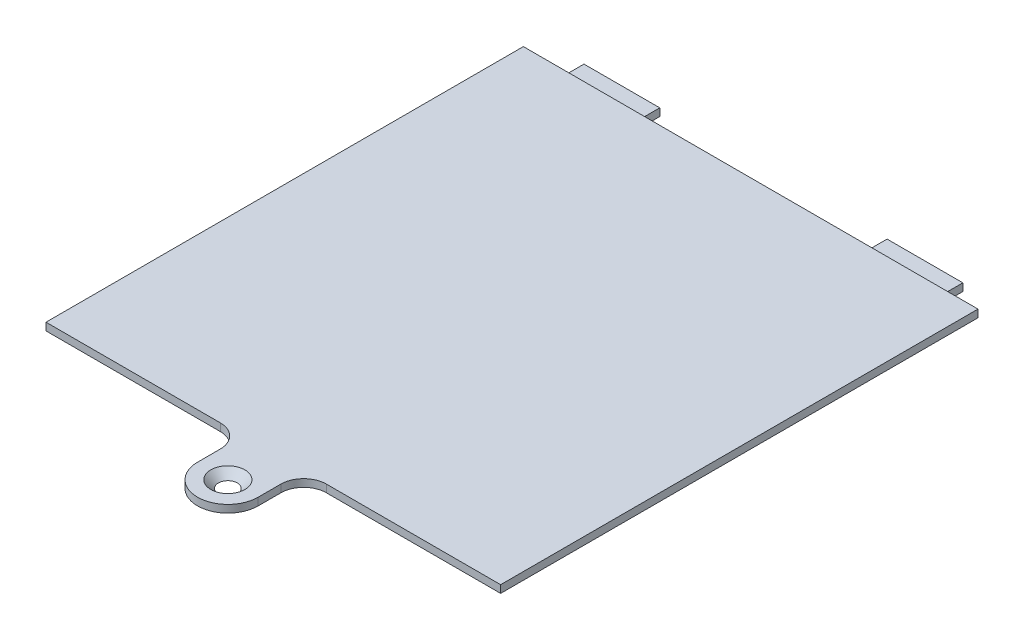
ISO-10303-21;
HEADER;
FILE_DESCRIPTION(('STEP AP214'),'2;1');
FILE_NAME('part.step','',(''),(''),'','','');
FILE_SCHEMA(('AUTOMOTIVE_DESIGN { 1 0 10303 214 1 1 1 1 }'));
ENDSEC;
DATA;
#1=APPLICATION_CONTEXT('core data for automotive mechanical design processes');
#2=APPLICATION_PROTOCOL_DEFINITION('international standard','automotive_design',2000,#1);
#3=PRODUCT_CONTEXT('',#1,'mechanical');
#4=PRODUCT('Part','Part','',(#3));
#5=PRODUCT_RELATED_PRODUCT_CATEGORY('part','',(#4));
#6=PRODUCT_DEFINITION_FORMATION('','',#4);
#7=PRODUCT_DEFINITION_CONTEXT('part definition',#1,'design');
#8=PRODUCT_DEFINITION('design','',#6,#7);
#9=PRODUCT_DEFINITION_SHAPE('','',#8);
#10=(LENGTH_UNIT() NAMED_UNIT(*) SI_UNIT(.MILLI.,.METRE.));
#11=(NAMED_UNIT(*) PLANE_ANGLE_UNIT() SI_UNIT($,.RADIAN.));
#12=(NAMED_UNIT(*) SI_UNIT($,.STERADIAN.) SOLID_ANGLE_UNIT());
#13=UNCERTAINTY_MEASURE_WITH_UNIT(LENGTH_MEASURE(1.E-05),#10,'distance_accuracy_value','');
#14=(GEOMETRIC_REPRESENTATION_CONTEXT(3) GLOBAL_UNCERTAINTY_ASSIGNED_CONTEXT((#13)) GLOBAL_UNIT_ASSIGNED_CONTEXT((#10,
#11,#12)) REPRESENTATION_CONTEXT('',''));
#15=CARTESIAN_POINT('',(0.,0.,0.));
#16=DIRECTION('',(0.,0.,1.));
#17=DIRECTION('',(1.,0.,0.));
#18=AXIS2_PLACEMENT_3D('',#15,#16,#17);
#19=CARTESIAN_POINT('',(0.,0.,0.));
#20=DIRECTION('',(0.,1.,0.));
#21=DIRECTION('',(0.,0.,1.));
#22=AXIS2_PLACEMENT_3D('',#19,#20,#21);
#23=PLANE('',#22);
#24=CARTESIAN_POINT('',(30.,0.,6.));
#25=DIRECTION('',(0.,1.,0.));
#26=DIRECTION('',(0.,0.,1.));
#27=AXIS2_PLACEMENT_3D('',#24,#25,#26);
#28=CIRCLE('',#27,1.25);
#29=CARTESIAN_POINT('',(30.,0.,7.25));
#30=VERTEX_POINT('',#29);
#31=EDGE_CURVE('E235',#30,#30,#28,.T.);
#32=ORIENTED_EDGE('',*,*,#31,.T.);
#33=EDGE_LOOP('',(#32));
#34=FACE_BOUND('',#33,.T.);
#35=DIRECTION('',(0.,0.,-1.));
#36=VECTOR('',#35,1.);
#37=CARTESIAN_POINT('',(45.,0.,-61.));
#38=LINE('',#37,#36);
#39=CARTESIAN_POINT('',(45.,0.,-60.));
#40=VERTEX_POINT('',#39);
#41=CARTESIAN_POINT('',(45.,0.,-63.));
#42=VERTEX_POINT('',#41);
#43=EDGE_CURVE('E50',#40,#42,#38,.T.);
#44=ORIENTED_EDGE('',*,*,#43,.F.);
#45=DIRECTION('',(1.,0.,0.));
#46=VECTOR('',#45,1.);
#47=CARTESIAN_POINT('',(55.,0.,-60.));
#48=LINE('',#47,#46);
#49=CARTESIAN_POINT('',(55.,0.,-60.));
#50=VERTEX_POINT('',#49);
#51=EDGE_CURVE('E312',#40,#50,#48,.T.);
#52=ORIENTED_EDGE('',*,*,#51,.T.);
#53=DIRECTION('',(0.,0.,1.));
#54=VECTOR('',#53,1.);
#55=CARTESIAN_POINT('',(55.,0.,-61.));
#56=LINE('',#55,#54);
#57=CARTESIAN_POINT('',(55.,0.,-63.));
#58=VERTEX_POINT('',#57);
#59=EDGE_CURVE('E58',#58,#50,#56,.T.);
#60=ORIENTED_EDGE('',*,*,#59,.F.);
#61=DIRECTION('',(1.,0.,0.));
#62=VECTOR('',#61,1.);
#63=CARTESIAN_POINT('',(0.,0.,-63.));
#64=LINE('',#63,#62);
#65=CARTESIAN_POINT('',(60.,0.,-63.));
#66=VERTEX_POINT('',#65);
#67=EDGE_CURVE('E267',#58,#66,#64,.T.);
#68=ORIENTED_EDGE('',*,*,#67,.T.);
#69=DIRECTION('',(0.,0.,-1.));
#70=VECTOR('',#69,1.);
#71=CARTESIAN_POINT('',(60.,0.,0.));
#72=LINE('',#71,#70);
#73=CARTESIAN_POINT('',(60.,0.,0.));
#74=VERTEX_POINT('',#73);
#75=EDGE_CURVE('E264',#74,#66,#72,.T.);
#76=ORIENTED_EDGE('',*,*,#75,.F.);
#77=DIRECTION('',(1.,0.,0.));
#78=VECTOR('',#77,1.);
#79=CARTESIAN_POINT('',(0.,0.,0.));
#80=LINE('',#79,#78);
#81=CARTESIAN_POINT('',(37.,0.,0.));
#82=VERTEX_POINT('',#81);
#83=EDGE_CURVE('E256',#82,#74,#80,.T.);
#84=ORIENTED_EDGE('',*,*,#83,.F.);
#85=CARTESIAN_POINT('',(37.,0.,3.));
#86=DIRECTION('',(0.,1.,0.));
#87=DIRECTION('',(0.,0.,1.));
#88=AXIS2_PLACEMENT_3D('',#85,#86,#87);
#89=CIRCLE('',#88,3.);
#90=CARTESIAN_POINT('',(34.,0.,3.));
#91=VERTEX_POINT('',#90);
#92=EDGE_CURVE('E301',#82,#91,#89,.T.);
#93=ORIENTED_EDGE('',*,*,#92,.T.);
#94=DIRECTION('',(0.,0.,-1.));
#95=VECTOR('',#94,1.);
#96=CARTESIAN_POINT('',(34.,0.,0.));
#97=LINE('',#96,#95);
#98=CARTESIAN_POINT('',(34.,0.,6.));
#99=VERTEX_POINT('',#98);
#100=EDGE_CURVE('E261',#99,#91,#97,.T.);
#101=ORIENTED_EDGE('',*,*,#100,.F.);
#102=CARTESIAN_POINT('',(30.,0.,6.));
#103=DIRECTION('',(0.,1.,0.));
#104=DIRECTION('',(0.,0.,1.));
#105=AXIS2_PLACEMENT_3D('',#102,#103,#104);
#106=CIRCLE('',#105,4.00000000000001);
#107=CARTESIAN_POINT('',(26.,0.,6.));
#108=VERTEX_POINT('',#107);
#109=EDGE_CURVE('E259',#108,#99,#106,.T.);
#110=ORIENTED_EDGE('',*,*,#109,.F.);
#111=DIRECTION('',(0.,0.,-1.));
#112=VECTOR('',#111,1.);
#113=CARTESIAN_POINT('',(26.,0.,0.));
#114=LINE('',#113,#112);
#115=CARTESIAN_POINT('',(26.,0.,3.));
#116=VERTEX_POINT('',#115);
#117=EDGE_CURVE('E255',#108,#116,#114,.T.);
#118=ORIENTED_EDGE('',*,*,#117,.T.);
#119=CARTESIAN_POINT('',(23.,0.,3.));
#120=DIRECTION('',(0.,1.,0.));
#121=DIRECTION('',(0.,0.,1.));
#122=AXIS2_PLACEMENT_3D('',#119,#120,#121);
#123=CIRCLE('',#122,3.);
#124=CARTESIAN_POINT('',(23.,0.,0.));
#125=VERTEX_POINT('',#124);
#126=EDGE_CURVE('E305',#116,#125,#123,.T.);
#127=ORIENTED_EDGE('',*,*,#126,.T.);
#128=CARTESIAN_POINT('',(0.,0.,0.));
#129=VERTEX_POINT('',#128);
#130=EDGE_CURVE('E230',#129,#125,#80,.T.);
#131=ORIENTED_EDGE('',*,*,#130,.F.);
#132=DIRECTION('',(0.,0.,-1.));
#133=VECTOR('',#132,1.);
#134=CARTESIAN_POINT('',(0.,0.,0.));
#135=LINE('',#134,#133);
#136=CARTESIAN_POINT('',(0.,0.,-63.));
#137=VERTEX_POINT('',#136);
#138=EDGE_CURVE('E271',#129,#137,#135,.T.);
#139=ORIENTED_EDGE('',*,*,#138,.T.);
#140=CARTESIAN_POINT('',(5.,0.,-63.));
#141=VERTEX_POINT('',#140);
#142=EDGE_CURVE('E268',#137,#141,#64,.T.);
#143=ORIENTED_EDGE('',*,*,#142,.T.);
#144=DIRECTION('',(0.,0.,-1.));
#145=VECTOR('',#144,1.);
#146=CARTESIAN_POINT('',(5.,0.,-61.));
#147=LINE('',#146,#145);
#148=CARTESIAN_POINT('',(5.,0.,-60.));
#149=VERTEX_POINT('',#148);
#150=EDGE_CURVE('E201',#149,#141,#147,.T.);
#151=ORIENTED_EDGE('',*,*,#150,.F.);
#152=DIRECTION('',(1.,0.,0.));
#153=VECTOR('',#152,1.);
#154=CARTESIAN_POINT('',(15.,0.,-60.));
#155=LINE('',#154,#153);
#156=CARTESIAN_POINT('',(15.,0.,-60.));
#157=VERTEX_POINT('',#156);
#158=EDGE_CURVE('E309',#149,#157,#155,.T.);
#159=ORIENTED_EDGE('',*,*,#158,.T.);
#160=DIRECTION('',(0.,0.,1.));
#161=VECTOR('',#160,1.);
#162=CARTESIAN_POINT('',(15.,0.,-61.));
#163=LINE('',#162,#161);
#164=CARTESIAN_POINT('',(15.,0.,-63.));
#165=VERTEX_POINT('',#164);
#166=EDGE_CURVE('E224',#165,#157,#163,.T.);
#167=ORIENTED_EDGE('',*,*,#166,.F.);
#168=EDGE_CURVE('E346',#165,#42,#64,.T.);
#169=ORIENTED_EDGE('',*,*,#168,.T.);
#170=EDGE_LOOP('',(#44,#52,#60,#68,#76,#84,#93,#101,#110,#118,#127,#131,#139,#143,#151,#159,
#167,#169));
#171=FACE_BOUND('',#170,.T.);
#172=ADVANCED_FACE('F35',(#34,#171),#23,.F.);
#173=CARTESIAN_POINT('',(0.,1.,0.));
#174=DIRECTION('',(0.,0.,-1.));
#175=DIRECTION('',(-1.,0.,0.));
#176=AXIS2_PLACEMENT_3D('',#173,#174,#175);
#177=PLANE('',#176);
#178=ORIENTED_EDGE('',*,*,#130,.T.);
#179=DIRECTION('',(0.,-1.,0.));
#180=VECTOR('',#179,1.);
#181=CARTESIAN_POINT('',(23.,1.,0.));
#182=LINE('',#181,#180);
#183=CARTESIAN_POINT('',(23.,1.,0.));
#184=VERTEX_POINT('',#183);
#185=EDGE_CURVE('E299',#125,#184,#182,.F.);
#186=ORIENTED_EDGE('',*,*,#185,.T.);
#187=DIRECTION('',(1.,0.,0.));
#188=VECTOR('',#187,1.);
#189=CARTESIAN_POINT('',(0.,1.,0.));
#190=LINE('',#189,#188);
#191=CARTESIAN_POINT('',(0.,1.,0.));
#192=VERTEX_POINT('',#191);
#193=EDGE_CURVE('E231',#192,#184,#190,.T.);
#194=ORIENTED_EDGE('',*,*,#193,.F.);
#195=DIRECTION('',(0.,-1.,0.));
#196=VECTOR('',#195,1.);
#197=CARTESIAN_POINT('',(0.,1.,0.));
#198=LINE('',#197,#196);
#199=EDGE_CURVE('E252',#192,#129,#198,.T.);
#200=ORIENTED_EDGE('',*,*,#199,.T.);
#201=EDGE_LOOP('',(#178,#186,#194,#200));
#202=FACE_BOUND('',#201,.T.);
#203=ADVANCED_FACE('F391',(#202),#177,.F.);
#204=CARTESIAN_POINT('',(26.,1.,0.));
#205=DIRECTION('',(-1.,0.,0.));
#206=DIRECTION('',(0.,0.,1.));
#207=AXIS2_PLACEMENT_3D('',#204,#205,#206);
#208=PLANE('',#207);
#209=DIRECTION('',(0.,0.,-1.));
#210=VECTOR('',#209,1.);
#211=CARTESIAN_POINT('',(26.,1.,0.));
#212=LINE('',#211,#210);
#213=CARTESIAN_POINT('',(26.,1.,6.));
#214=VERTEX_POINT('',#213);
#215=CARTESIAN_POINT('',(26.,1.,3.));
#216=VERTEX_POINT('',#215);
#217=EDGE_CURVE('E234',#214,#216,#212,.T.);
#218=ORIENTED_EDGE('',*,*,#217,.T.);
#219=DIRECTION('',(0.,-1.,0.));
#220=VECTOR('',#219,1.);
#221=CARTESIAN_POINT('',(26.,1.,3.));
#222=LINE('',#221,#220);
#223=EDGE_CURVE('E296',#216,#116,#222,.T.);
#224=ORIENTED_EDGE('',*,*,#223,.T.);
#225=ORIENTED_EDGE('',*,*,#117,.F.);
#226=DIRECTION('',(0.,-1.,0.));
#227=VECTOR('',#226,1.);
#228=CARTESIAN_POINT('',(26.,1.,6.));
#229=LINE('',#228,#227);
#230=EDGE_CURVE('E289',#214,#108,#229,.T.);
#231=ORIENTED_EDGE('',*,*,#230,.F.);
#232=EDGE_LOOP('',(#218,#224,#225,#231));
#233=FACE_BOUND('',#232,.T.);
#234=ADVANCED_FACE('F382',(#233),#208,.T.);
#235=CARTESIAN_POINT('',(30.,1.,6.));
#236=DIRECTION('',(0.,-1.,0.));
#237=DIRECTION('',(0.,0.,-1.));
#238=AXIS2_PLACEMENT_3D('',#235,#236,#237);
#239=CYLINDRICAL_SURFACE('',#238,4.00000000000001);
#240=ORIENTED_EDGE('',*,*,#109,.T.);
#241=DIRECTION('',(0.,-1.,0.));
#242=VECTOR('',#241,1.);
#243=CARTESIAN_POINT('',(34.,1.,6.));
#244=LINE('',#243,#242);
#245=CARTESIAN_POINT('',(34.,1.,6.));
#246=VERTEX_POINT('',#245);
#247=EDGE_CURVE('E286',#246,#99,#244,.T.);
#248=ORIENTED_EDGE('',*,*,#247,.F.);
#249=CARTESIAN_POINT('',(30.,1.,6.));
#250=DIRECTION('',(0.,1.,0.));
#251=DIRECTION('',(0.,0.,1.));
#252=AXIS2_PLACEMENT_3D('',#249,#250,#251);
#253=CIRCLE('',#252,4.00000000000001);
#254=EDGE_CURVE('E239',#214,#246,#253,.T.);
#255=ORIENTED_EDGE('',*,*,#254,.F.);
#256=ORIENTED_EDGE('',*,*,#230,.T.);
#257=EDGE_LOOP('',(#240,#248,#255,#256));
#258=FACE_BOUND('',#257,.T.);
#259=ADVANCED_FACE('F379',(#258),#239,.T.);
#260=CARTESIAN_POINT('',(34.,1.,0.));
#261=DIRECTION('',(-1.,0.,0.));
#262=DIRECTION('',(0.,0.,1.));
#263=AXIS2_PLACEMENT_3D('',#260,#261,#262);
#264=PLANE('',#263);
#265=ORIENTED_EDGE('',*,*,#100,.T.);
#266=DIRECTION('',(0.,-1.,0.));
#267=VECTOR('',#266,1.);
#268=CARTESIAN_POINT('',(34.,1.,3.));
#269=LINE('',#268,#267);
#270=CARTESIAN_POINT('',(34.,1.,3.));
#271=VERTEX_POINT('',#270);
#272=EDGE_CURVE('E294',#91,#271,#269,.F.);
#273=ORIENTED_EDGE('',*,*,#272,.T.);
#274=DIRECTION('',(0.,0.,-1.));
#275=VECTOR('',#274,1.);
#276=CARTESIAN_POINT('',(34.,1.,0.));
#277=LINE('',#276,#275);
#278=EDGE_CURVE('E241',#246,#271,#277,.T.);
#279=ORIENTED_EDGE('',*,*,#278,.F.);
#280=ORIENTED_EDGE('',*,*,#247,.T.);
#281=EDGE_LOOP('',(#265,#273,#279,#280));
#282=FACE_BOUND('',#281,.T.);
#283=ADVANCED_FACE('F369',(#282),#264,.F.);
#284=CARTESIAN_POINT('',(37.,1.,0.));
#285=VERTEX_POINT('',#284);
#286=CARTESIAN_POINT('',(60.,1.,0.));
#287=VERTEX_POINT('',#286);
#288=EDGE_CURVE('E236',#285,#287,#190,.T.);
#289=ORIENTED_EDGE('',*,*,#288,.F.);
#290=DIRECTION('',(0.,-1.,0.));
#291=VECTOR('',#290,1.);
#292=CARTESIAN_POINT('',(37.,0.,0.));
#293=LINE('',#292,#291);
#294=EDGE_CURVE('E291',#285,#82,#293,.T.);
#295=ORIENTED_EDGE('',*,*,#294,.T.);
#296=ORIENTED_EDGE('',*,*,#83,.T.);
#297=DIRECTION('',(0.,-1.,0.));
#298=VECTOR('',#297,1.);
#299=CARTESIAN_POINT('',(60.,1.,0.));
#300=LINE('',#299,#298);
#301=EDGE_CURVE('E283',#287,#74,#300,.T.);
#302=ORIENTED_EDGE('',*,*,#301,.F.);
#303=EDGE_LOOP('',(#289,#295,#296,#302));
#304=FACE_BOUND('',#303,.T.);
#305=ADVANCED_FACE('F362',(#304),#177,.F.);
#306=CARTESIAN_POINT('',(60.,1.,0.));
#307=DIRECTION('',(-1.,0.,0.));
#308=DIRECTION('',(0.,0.,1.));
#309=AXIS2_PLACEMENT_3D('',#306,#307,#308);
#310=PLANE('',#309);
#311=ORIENTED_EDGE('',*,*,#75,.T.);
#312=DIRECTION('',(0.,-1.,0.));
#313=VECTOR('',#312,1.);
#314=CARTESIAN_POINT('',(60.,1.,-63.));
#315=LINE('',#314,#313);
#316=CARTESIAN_POINT('',(60.,1.,-63.));
#317=VERTEX_POINT('',#316);
#318=EDGE_CURVE('E280',#317,#66,#315,.T.);
#319=ORIENTED_EDGE('',*,*,#318,.F.);
#320=DIRECTION('',(0.,0.,-1.));
#321=VECTOR('',#320,1.);
#322=CARTESIAN_POINT('',(60.,1.,0.));
#323=LINE('',#322,#321);
#324=EDGE_CURVE('E244',#287,#317,#323,.T.);
#325=ORIENTED_EDGE('',*,*,#324,.F.);
#326=ORIENTED_EDGE('',*,*,#301,.T.);
#327=EDGE_LOOP('',(#311,#319,#325,#326));
#328=FACE_BOUND('',#327,.T.);
#329=ADVANCED_FACE('F358',(#328),#310,.F.);
#330=CARTESIAN_POINT('',(0.,1.,-63.));
#331=DIRECTION('',(0.,0.,-1.));
#332=DIRECTION('',(-1.,0.,0.));
#333=AXIS2_PLACEMENT_3D('',#330,#331,#332);
#334=PLANE('',#333);
#335=ORIENTED_EDGE('',*,*,#142,.F.);
#336=DIRECTION('',(0.,-1.,0.));
#337=VECTOR('',#336,1.);
#338=CARTESIAN_POINT('',(0.,1.,-63.));
#339=LINE('',#338,#337);
#340=CARTESIAN_POINT('',(0.,1.,-63.));
#341=VERTEX_POINT('',#340);
#342=EDGE_CURVE('E278',#341,#137,#339,.T.);
#343=ORIENTED_EDGE('',*,*,#342,.F.);
#344=DIRECTION('',(1.,0.,0.));
#345=VECTOR('',#344,1.);
#346=CARTESIAN_POINT('',(0.,1.,-63.));
#347=LINE('',#346,#345);
#348=EDGE_CURVE('E246',#341,#317,#347,.T.);
#349=ORIENTED_EDGE('',*,*,#348,.T.);
#350=ORIENTED_EDGE('',*,*,#318,.T.);
#351=ORIENTED_EDGE('',*,*,#67,.F.);
#352=EDGE_CURVE('E347',#42,#58,#64,.T.);
#353=ORIENTED_EDGE('',*,*,#352,.F.);
#354=ORIENTED_EDGE('',*,*,#168,.F.);
#355=EDGE_CURVE('E272',#141,#165,#64,.T.);
#356=ORIENTED_EDGE('',*,*,#355,.F.);
#357=EDGE_LOOP('',(#335,#343,#349,#350,#351,#353,#354,#356));
#358=FACE_BOUND('',#357,.T.);
#359=ADVANCED_FACE('F354',(#358),#334,.T.);
#360=CARTESIAN_POINT('',(0.,1.,0.));
#361=DIRECTION('',(-1.,0.,0.));
#362=DIRECTION('',(0.,0.,1.));
#363=AXIS2_PLACEMENT_3D('',#360,#361,#362);
#364=PLANE('',#363);
#365=ORIENTED_EDGE('',*,*,#138,.F.);
#366=ORIENTED_EDGE('',*,*,#199,.F.);
#367=DIRECTION('',(0.,0.,-1.));
#368=VECTOR('',#367,1.);
#369=CARTESIAN_POINT('',(0.,1.,0.));
#370=LINE('',#369,#368);
#371=EDGE_CURVE('E249',#192,#341,#370,.T.);
#372=ORIENTED_EDGE('',*,*,#371,.T.);
#373=ORIENTED_EDGE('',*,*,#342,.T.);
#374=EDGE_LOOP('',(#365,#366,#372,#373));
#375=FACE_BOUND('',#374,.T.);
#376=ADVANCED_FACE('F395',(#375),#364,.T.);
#377=CARTESIAN_POINT('',(0.,1.,0.));
#378=DIRECTION('',(0.,1.,0.));
#379=DIRECTION('',(0.,0.,1.));
#380=AXIS2_PLACEMENT_3D('',#377,#378,#379);
#381=PLANE('',#380);
#382=CARTESIAN_POINT('',(30.,1.,6.));
#383=DIRECTION('',(0.,1.,0.));
#384=DIRECTION('',(0.,0.,1.));
#385=AXIS2_PLACEMENT_3D('',#382,#383,#384);
#386=CIRCLE('',#385,2.25);
#387=CARTESIAN_POINT('',(30.,1.,8.25));
#388=VERTEX_POINT('',#387);
#389=EDGE_CURVE('E11',#388,#388,#386,.F.);
#390=ORIENTED_EDGE('',*,*,#389,.T.);
#391=EDGE_LOOP('',(#390));
#392=FACE_BOUND('',#391,.T.);
#393=ORIENTED_EDGE('',*,*,#193,.T.);
#394=CARTESIAN_POINT('',(23.,1.,3.));
#395=DIRECTION('',(0.,1.,0.));
#396=DIRECTION('',(0.,0.,1.));
#397=AXIS2_PLACEMENT_3D('',#394,#395,#396);
#398=CIRCLE('',#397,3.);
#399=EDGE_CURVE('E307',#184,#216,#398,.F.);
#400=ORIENTED_EDGE('',*,*,#399,.T.);
#401=ORIENTED_EDGE('',*,*,#217,.F.);
#402=ORIENTED_EDGE('',*,*,#254,.T.);
#403=ORIENTED_EDGE('',*,*,#278,.T.);
#404=CARTESIAN_POINT('',(37.,1.,3.));
#405=DIRECTION('',(0.,1.,0.));
#406=DIRECTION('',(0.,0.,1.));
#407=AXIS2_PLACEMENT_3D('',#404,#405,#406);
#408=CIRCLE('',#407,3.);
#409=EDGE_CURVE('E303',#271,#285,#408,.F.);
#410=ORIENTED_EDGE('',*,*,#409,.T.);
#411=ORIENTED_EDGE('',*,*,#288,.T.);
#412=ORIENTED_EDGE('',*,*,#324,.T.);
#413=ORIENTED_EDGE('',*,*,#348,.F.);
#414=ORIENTED_EDGE('',*,*,#371,.F.);
#415=EDGE_LOOP('',(#393,#400,#401,#402,#403,#410,#411,#412,#413,#414));
#416=FACE_BOUND('',#415,.T.);
#417=ADVANCED_FACE('F375',(#392,#416),#381,.T.);
#418=CARTESIAN_POINT('',(37.,1.,3.));
#419=DIRECTION('',(0.,1.,0.));
#420=DIRECTION('',(0.,0.,1.));
#421=AXIS2_PLACEMENT_3D('',#418,#419,#420);
#422=CYLINDRICAL_SURFACE('',#421,3.);
#423=ORIENTED_EDGE('',*,*,#409,.F.);
#424=ORIENTED_EDGE('',*,*,#272,.F.);
#425=ORIENTED_EDGE('',*,*,#92,.F.);
#426=ORIENTED_EDGE('',*,*,#294,.F.);
#427=EDGE_LOOP('',(#423,#424,#425,#426));
#428=FACE_BOUND('',#427,.T.);
#429=ADVANCED_FACE('F373',(#428),#422,.F.);
#430=CARTESIAN_POINT('',(23.,1.,3.));
#431=DIRECTION('',(0.,-1.,0.));
#432=DIRECTION('',(0.,0.,-1.));
#433=AXIS2_PLACEMENT_3D('',#430,#431,#432);
#434=CYLINDRICAL_SURFACE('',#433,3.);
#435=ORIENTED_EDGE('',*,*,#399,.F.);
#436=ORIENTED_EDGE('',*,*,#185,.F.);
#437=ORIENTED_EDGE('',*,*,#126,.F.);
#438=ORIENTED_EDGE('',*,*,#223,.F.);
#439=EDGE_LOOP('',(#435,#436,#437,#438));
#440=FACE_BOUND('',#439,.T.);
#441=ADVANCED_FACE('F386',(#440),#434,.F.);
#442=CARTESIAN_POINT('',(0.,0.,0.));
#443=DIRECTION('',(0.,-1.,0.));
#444=DIRECTION('',(0.,0.,-1.));
#445=AXIS2_PLACEMENT_3D('',#442,#443,#444);
#446=PLANE('',#445);
#447=CARTESIAN_POINT('',(5.,0.,-66.));
#448=VERTEX_POINT('',#447);
#449=EDGE_CURVE('E199',#141,#448,#147,.T.);
#450=ORIENTED_EDGE('',*,*,#449,.F.);
#451=ORIENTED_EDGE('',*,*,#355,.T.);
#452=CARTESIAN_POINT('',(15.,0.,-66.));
#453=VERTEX_POINT('',#452);
#454=EDGE_CURVE('E210',#453,#165,#163,.T.);
#455=ORIENTED_EDGE('',*,*,#454,.F.);
#456=DIRECTION('',(1.,0.,0.));
#457=VECTOR('',#456,1.);
#458=CARTESIAN_POINT('',(5.,0.,-66.));
#459=LINE('',#458,#457);
#460=EDGE_CURVE('E220',#448,#453,#459,.T.);
#461=ORIENTED_EDGE('',*,*,#460,.F.);
#462=EDGE_LOOP('',(#450,#451,#455,#461));
#463=FACE_BOUND('',#462,.T.);
#464=ADVANCED_FACE('F342',(#463),#446,.F.);
#465=CARTESIAN_POINT('',(5.,-1.,-61.));
#466=DIRECTION('',(1.,0.,0.));
#467=DIRECTION('',(0.,0.,-1.));
#468=AXIS2_PLACEMENT_3D('',#465,#466,#467);
#469=PLANE('',#468);
#470=ORIENTED_EDGE('',*,*,#150,.T.);
#471=ORIENTED_EDGE('',*,*,#449,.T.);
#472=DIRECTION('',(0.,1.,0.));
#473=VECTOR('',#472,1.);
#474=CARTESIAN_POINT('',(5.,-1.,-66.));
#475=LINE('',#474,#473);
#476=CARTESIAN_POINT('',(5.,-1.,-66.));
#477=VERTEX_POINT('',#476);
#478=EDGE_CURVE('E227',#477,#448,#475,.T.);
#479=ORIENTED_EDGE('',*,*,#478,.F.);
#480=DIRECTION('',(0.,0.,-1.));
#481=VECTOR('',#480,1.);
#482=CARTESIAN_POINT('',(5.,-1.,-61.));
#483=LINE('',#482,#481);
#484=CARTESIAN_POINT('',(5.,-1.,-61.));
#485=VERTEX_POINT('',#484);
#486=EDGE_CURVE('E206',#485,#477,#483,.T.);
#487=ORIENTED_EDGE('',*,*,#486,.F.);
#488=DIRECTION('',(0.,-0.707106781186552,-0.707106781186543));
#489=VECTOR('',#488,1.);
#490=CARTESIAN_POINT('',(5.,-1.00000000000001,-61.));
#491=LINE('',#490,#489);
#492=EDGE_CURVE('E318',#485,#149,#491,.F.);
#493=ORIENTED_EDGE('',*,*,#492,.T.);
#494=EDGE_LOOP('',(#470,#471,#479,#487,#493));
#495=FACE_BOUND('',#494,.T.);
#496=ADVANCED_FACE('F333',(#495),#469,.F.);
#497=CARTESIAN_POINT('',(5.,-1.,-66.));
#498=DIRECTION('',(0.,0.,1.));
#499=DIRECTION('',(1.,0.,0.));
#500=AXIS2_PLACEMENT_3D('',#497,#498,#499);
#501=PLANE('',#500);
#502=ORIENTED_EDGE('',*,*,#460,.T.);
#503=DIRECTION('',(0.,1.,0.));
#504=VECTOR('',#503,1.);
#505=CARTESIAN_POINT('',(15.,-1.,-66.));
#506=LINE('',#505,#504);
#507=CARTESIAN_POINT('',(15.,-1.,-66.));
#508=VERTEX_POINT('',#507);
#509=EDGE_CURVE('E217',#508,#453,#506,.T.);
#510=ORIENTED_EDGE('',*,*,#509,.F.);
#511=DIRECTION('',(1.,0.,0.));
#512=VECTOR('',#511,1.);
#513=CARTESIAN_POINT('',(5.,-1.,-66.));
#514=LINE('',#513,#512);
#515=EDGE_CURVE('E209',#477,#508,#514,.T.);
#516=ORIENTED_EDGE('',*,*,#515,.F.);
#517=ORIENTED_EDGE('',*,*,#478,.T.);
#518=EDGE_LOOP('',(#502,#510,#516,#517));
#519=FACE_BOUND('',#518,.T.);
#520=ADVANCED_FACE('F338',(#519),#501,.F.);
#521=CARTESIAN_POINT('',(15.,-1.,-61.));
#522=DIRECTION('',(-1.,0.,0.));
#523=DIRECTION('',(0.,0.,1.));
#524=AXIS2_PLACEMENT_3D('',#521,#522,#523);
#525=PLANE('',#524);
#526=ORIENTED_EDGE('',*,*,#454,.T.);
#527=ORIENTED_EDGE('',*,*,#166,.T.);
#528=DIRECTION('',(0.,0.707106781186552,0.707106781186543));
#529=VECTOR('',#528,1.);
#530=CARTESIAN_POINT('',(15.,-1.00000000000001,-61.));
#531=LINE('',#530,#529);
#532=CARTESIAN_POINT('',(15.,-1.,-61.));
#533=VERTEX_POINT('',#532);
#534=EDGE_CURVE('E43',#157,#533,#531,.F.);
#535=ORIENTED_EDGE('',*,*,#534,.T.);
#536=DIRECTION('',(0.,0.,1.));
#537=VECTOR('',#536,1.);
#538=CARTESIAN_POINT('',(15.,-1.,-61.));
#539=LINE('',#538,#537);
#540=EDGE_CURVE('E212',#508,#533,#539,.T.);
#541=ORIENTED_EDGE('',*,*,#540,.F.);
#542=ORIENTED_EDGE('',*,*,#509,.T.);
#543=EDGE_LOOP('',(#526,#527,#535,#541,#542));
#544=FACE_BOUND('',#543,.T.);
#545=ADVANCED_FACE('F323',(#544),#525,.F.);
#546=CARTESIAN_POINT('',(0.,-1.,0.));
#547=DIRECTION('',(0.,-1.,0.));
#548=DIRECTION('',(0.,0.,-1.));
#549=AXIS2_PLACEMENT_3D('',#546,#547,#548);
#550=PLANE('',#549);
#551=ORIENTED_EDGE('',*,*,#486,.T.);
#552=ORIENTED_EDGE('',*,*,#515,.T.);
#553=ORIENTED_EDGE('',*,*,#540,.T.);
#554=DIRECTION('',(-1.,0.,0.));
#555=VECTOR('',#554,1.);
#556=CARTESIAN_POINT('',(5.,-1.,-61.));
#557=LINE('',#556,#555);
#558=EDGE_CURVE('E215',#533,#485,#557,.T.);
#559=ORIENTED_EDGE('',*,*,#558,.T.);
#560=EDGE_LOOP('',(#551,#552,#553,#559));
#561=FACE_BOUND('',#560,.T.);
#562=ADVANCED_FACE('F328',(#561),#550,.T.);
#563=CARTESIAN_POINT('',(45.,-1.,-61.));
#564=DIRECTION('',(1.,0.,0.));
#565=DIRECTION('',(0.,0.,-1.));
#566=AXIS2_PLACEMENT_3D('',#563,#564,#565);
#567=PLANE('',#566);
#568=ORIENTED_EDGE('',*,*,#43,.T.);
#569=CARTESIAN_POINT('',(45.,0.,-66.));
#570=VERTEX_POINT('',#569);
#571=EDGE_CURVE('E197',#42,#570,#38,.T.);
#572=ORIENTED_EDGE('',*,*,#571,.T.);
#573=DIRECTION('',(0.,1.,0.));
#574=VECTOR('',#573,1.);
#575=CARTESIAN_POINT('',(45.,-1.,-66.));
#576=LINE('',#575,#574);
#577=CARTESIAN_POINT('',(45.,-1.,-66.));
#578=VERTEX_POINT('',#577);
#579=EDGE_CURVE('E178',#578,#570,#576,.T.);
#580=ORIENTED_EDGE('',*,*,#579,.F.);
#581=DIRECTION('',(0.,0.,-1.));
#582=VECTOR('',#581,1.);
#583=CARTESIAN_POINT('',(45.,-1.,-61.));
#584=LINE('',#583,#582);
#585=CARTESIAN_POINT('',(45.,-1.,-61.));
#586=VERTEX_POINT('',#585);
#587=EDGE_CURVE('E185',#586,#578,#584,.T.);
#588=ORIENTED_EDGE('',*,*,#587,.F.);
#589=DIRECTION('',(0.,-0.707106781186552,-0.707106781186543));
#590=VECTOR('',#589,1.);
#591=CARTESIAN_POINT('',(45.,-1.00000000000001,-61.));
#592=LINE('',#591,#590);
#593=EDGE_CURVE('E314',#586,#40,#592,.F.);
#594=ORIENTED_EDGE('',*,*,#593,.T.);
#595=EDGE_LOOP('',(#568,#572,#580,#588,#594));
#596=FACE_BOUND('',#595,.T.);
#597=ADVANCED_FACE('F195',(#596),#567,.F.);
#598=CARTESIAN_POINT('',(45.,-1.,-66.));
#599=DIRECTION('',(0.,0.,1.));
#600=DIRECTION('',(1.,0.,0.));
#601=AXIS2_PLACEMENT_3D('',#598,#599,#600);
#602=PLANE('',#601);
#603=DIRECTION('',(1.,0.,0.));
#604=VECTOR('',#603,1.);
#605=CARTESIAN_POINT('',(45.,0.,-66.));
#606=LINE('',#605,#604);
#607=CARTESIAN_POINT('',(55.,0.,-66.));
#608=VERTEX_POINT('',#607);
#609=EDGE_CURVE('E633',#570,#608,#606,.T.);
#610=ORIENTED_EDGE('',*,*,#609,.T.);
#611=DIRECTION('',(0.,1.,0.));
#612=VECTOR('',#611,1.);
#613=CARTESIAN_POINT('',(55.,-1.,-66.));
#614=LINE('',#613,#612);
#615=CARTESIAN_POINT('',(55.,-1.,-66.));
#616=VERTEX_POINT('',#615);
#617=EDGE_CURVE('E180',#616,#608,#614,.T.);
#618=ORIENTED_EDGE('',*,*,#617,.F.);
#619=DIRECTION('',(1.,0.,0.));
#620=VECTOR('',#619,1.);
#621=CARTESIAN_POINT('',(45.,-1.,-66.));
#622=LINE('',#621,#620);
#623=EDGE_CURVE('E174',#578,#616,#622,.T.);
#624=ORIENTED_EDGE('',*,*,#623,.F.);
#625=ORIENTED_EDGE('',*,*,#579,.T.);
#626=EDGE_LOOP('',(#610,#618,#624,#625));
#627=FACE_BOUND('',#626,.T.);
#628=ADVANCED_FACE('F176',(#627),#602,.F.);
#629=CARTESIAN_POINT('',(55.,-1.,-61.));
#630=DIRECTION('',(-1.,0.,0.));
#631=DIRECTION('',(0.,0.,1.));
#632=AXIS2_PLACEMENT_3D('',#629,#630,#631);
#633=PLANE('',#632);
#634=EDGE_CURVE('E193',#608,#58,#56,.T.);
#635=ORIENTED_EDGE('',*,*,#634,.T.);
#636=ORIENTED_EDGE('',*,*,#59,.T.);
#637=DIRECTION('',(0.,0.707106781186552,0.707106781186543));
#638=VECTOR('',#637,1.);
#639=CARTESIAN_POINT('',(55.,-1.00000000000001,-61.));
#640=LINE('',#639,#638);
#641=CARTESIAN_POINT('',(55.,-1.,-61.));
#642=VERTEX_POINT('',#641);
#643=EDGE_CURVE('E316',#50,#642,#640,.F.);
#644=ORIENTED_EDGE('',*,*,#643,.T.);
#645=DIRECTION('',(0.,0.,1.));
#646=VECTOR('',#645,1.);
#647=CARTESIAN_POINT('',(55.,-1.,-61.));
#648=LINE('',#647,#646);
#649=EDGE_CURVE('E184',#616,#642,#648,.T.);
#650=ORIENTED_EDGE('',*,*,#649,.F.);
#651=ORIENTED_EDGE('',*,*,#617,.T.);
#652=EDGE_LOOP('',(#635,#636,#644,#650,#651));
#653=FACE_BOUND('',#652,.T.);
#654=ADVANCED_FACE('F427',(#653),#633,.F.);
#655=CARTESIAN_POINT('',(0.,-1.,0.));
#656=DIRECTION('',(0.,-1.,0.));
#657=DIRECTION('',(0.,0.,-1.));
#658=AXIS2_PLACEMENT_3D('',#655,#656,#657);
#659=PLANE('',#658);
#660=ORIENTED_EDGE('',*,*,#587,.T.);
#661=ORIENTED_EDGE('',*,*,#623,.T.);
#662=ORIENTED_EDGE('',*,*,#649,.T.);
#663=DIRECTION('',(-1.,0.,0.));
#664=VECTOR('',#663,1.);
#665=CARTESIAN_POINT('',(45.,-1.,-61.));
#666=LINE('',#665,#664);
#667=EDGE_CURVE('E191',#642,#586,#666,.T.);
#668=ORIENTED_EDGE('',*,*,#667,.T.);
#669=EDGE_LOOP('',(#660,#661,#662,#668));
#670=FACE_BOUND('',#669,.T.);
#671=ADVANCED_FACE('F189',(#670),#659,.T.);
#672=CARTESIAN_POINT('',(0.,0.,0.));
#673=DIRECTION('',(0.,-1.,0.));
#674=DIRECTION('',(0.,0.,-1.));
#675=AXIS2_PLACEMENT_3D('',#672,#673,#674);
#676=PLANE('',#675);
#677=ORIENTED_EDGE('',*,*,#352,.T.);
#678=ORIENTED_EDGE('',*,*,#634,.F.);
#679=ORIENTED_EDGE('',*,*,#609,.F.);
#680=ORIENTED_EDGE('',*,*,#571,.F.);
#681=EDGE_LOOP('',(#677,#678,#679,#680));
#682=FACE_BOUND('',#681,.T.);
#683=ADVANCED_FACE('F430',(#682),#676,.F.);
#684=CARTESIAN_POINT('',(45.,-1.00000000000001,-61.));
#685=DIRECTION('',(0.,-0.707106781186542,0.707106781186552));
#686=DIRECTION('',(1.,0.,0.));
#687=AXIS2_PLACEMENT_3D('',#684,#685,#686);
#688=PLANE('',#687);
#689=ORIENTED_EDGE('',*,*,#643,.F.);
#690=ORIENTED_EDGE('',*,*,#51,.F.);
#691=ORIENTED_EDGE('',*,*,#593,.F.);
#692=ORIENTED_EDGE('',*,*,#667,.F.);
#693=EDGE_LOOP('',(#689,#690,#691,#692));
#694=FACE_BOUND('',#693,.T.);
#695=ADVANCED_FACE('F433',(#694),#688,.T.);
#696=CARTESIAN_POINT('',(5.,-1.00000000000001,-61.));
#697=DIRECTION('',(0.,-0.707106781186542,0.707106781186552));
#698=DIRECTION('',(1.,0.,0.));
#699=AXIS2_PLACEMENT_3D('',#696,#697,#698);
#700=PLANE('',#699);
#701=ORIENTED_EDGE('',*,*,#534,.F.);
#702=ORIENTED_EDGE('',*,*,#158,.F.);
#703=ORIENTED_EDGE('',*,*,#492,.F.);
#704=ORIENTED_EDGE('',*,*,#558,.F.);
#705=EDGE_LOOP('',(#701,#702,#703,#704));
#706=FACE_BOUND('',#705,.T.);
#707=ADVANCED_FACE('F331',(#706),#700,.T.);
#708=CARTESIAN_POINT('',(30.,0.,6.));
#709=DIRECTION('',(0.,1.,0.));
#710=DIRECTION('',(0.,0.,1.));
#711=AXIS2_PLACEMENT_3D('',#708,#709,#710);
#712=CONICAL_SURFACE('',#711,1.25,0.785398163397453);
#713=ORIENTED_EDGE('',*,*,#389,.F.);
#714=EDGE_LOOP('',(#713));
#715=FACE_BOUND('',#714,.T.);
#716=ORIENTED_EDGE('',*,*,#31,.F.);
#717=EDGE_LOOP('',(#716));
#718=FACE_BOUND('',#717,.T.);
#719=ADVANCED_FACE('F37',(#715,#718),#712,.F.);
#720=CLOSED_SHELL('',(#172,#203,#234,#259,#283,#305,#329,#359,#376,#417,#429,#441,#464,#496,
#520,#545,#562,#597,#628,#654,#671,#683,#695,#707,#719));
#721=MANIFOLD_SOLID_BREP('B2',#720);
#722=ADVANCED_BREP_SHAPE_REPRESENTATION('',(#18,#721),#14);
#723=SHAPE_DEFINITION_REPRESENTATION(#9,#722);
ENDSEC;
END-ISO-10303-21;
